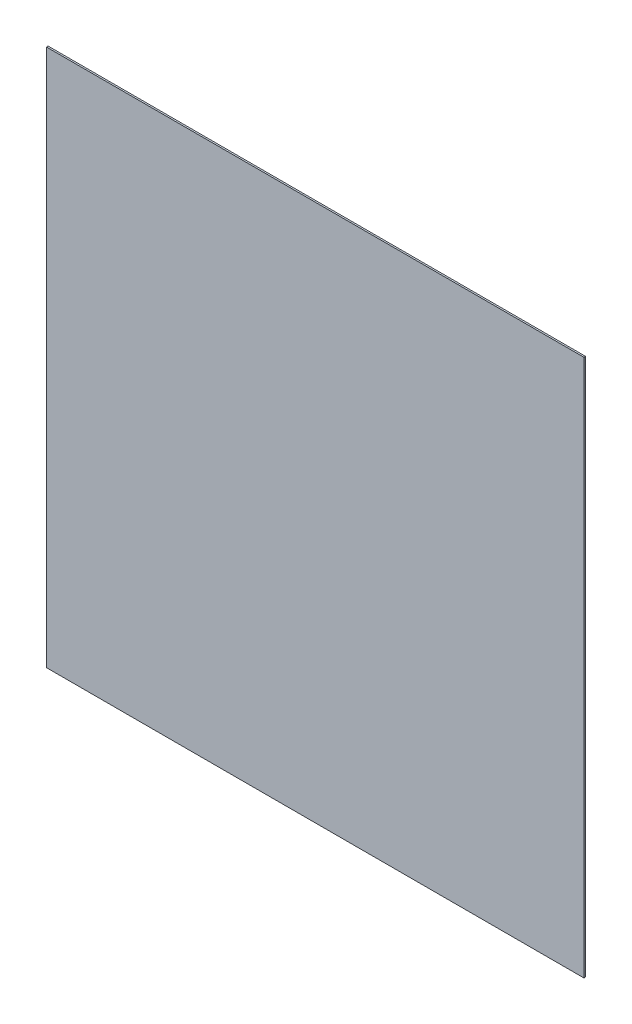
ISO-10303-21;
HEADER;
FILE_DESCRIPTION(('STEP AP214'),'2;1');
FILE_NAME('part.step','',(''),(''),'','','');
FILE_SCHEMA(('AUTOMOTIVE_DESIGN { 1 0 10303 214 1 1 1 1 }'));
ENDSEC;
DATA;
#1=APPLICATION_CONTEXT('core data for automotive mechanical design processes');
#2=APPLICATION_PROTOCOL_DEFINITION('international standard','automotive_design',2000,#1);
#3=PRODUCT_CONTEXT('',#1,'mechanical');
#4=PRODUCT('Part','Part','',(#3));
#5=PRODUCT_RELATED_PRODUCT_CATEGORY('part','',(#4));
#6=PRODUCT_DEFINITION_FORMATION('','',#4);
#7=PRODUCT_DEFINITION_CONTEXT('part definition',#1,'design');
#8=PRODUCT_DEFINITION('design','',#6,#7);
#9=PRODUCT_DEFINITION_SHAPE('','',#8);
#10=(LENGTH_UNIT() NAMED_UNIT(*) SI_UNIT(.MILLI.,.METRE.));
#11=(NAMED_UNIT(*) PLANE_ANGLE_UNIT() SI_UNIT($,.RADIAN.));
#12=(NAMED_UNIT(*) SI_UNIT($,.STERADIAN.) SOLID_ANGLE_UNIT());
#13=UNCERTAINTY_MEASURE_WITH_UNIT(LENGTH_MEASURE(1.E-05),#10,'distance_accuracy_value','');
#14=(GEOMETRIC_REPRESENTATION_CONTEXT(3) GLOBAL_UNCERTAINTY_ASSIGNED_CONTEXT((#13)) GLOBAL_UNIT_ASSIGNED_CONTEXT((#10,
#11,#12)) REPRESENTATION_CONTEXT('',''));
#15=CARTESIAN_POINT('',(0.,0.,0.));
#16=DIRECTION('',(0.,0.,1.));
#17=DIRECTION('',(1.,0.,0.));
#18=AXIS2_PLACEMENT_3D('',#15,#16,#17);
#19=CARTESIAN_POINT('',(62.7700680934936,44.9155550842403,13.74394));
#20=DIRECTION('',(0.,1.,0.));
#21=DIRECTION('',(0.,0.,-1.));
#22=AXIS2_PLACEMENT_3D('',#19,#20,#21);
#23=PLANE('',#22);
#24=DIRECTION('',(1.,0.,0.));
#25=VECTOR('',#24,1.);
#26=CARTESIAN_POINT('',(57.8170680934936,44.9155550842403,13.716));
#27=LINE('',#26,#25);
#28=CARTESIAN_POINT('',(53.6895680934936,44.9155550842403,13.716));
#29=VERTEX_POINT('',#28);
#30=CARTESIAN_POINT('',(61.9445680934936,44.9155550842403,13.716));
#31=VERTEX_POINT('',#30);
#32=EDGE_CURVE('E77',#29,#31,#27,.T.);
#33=ORIENTED_EDGE('',*,*,#32,.F.);
#34=DIRECTION('',(0.,0.,-1.));
#35=VECTOR('',#34,1.);
#36=CARTESIAN_POINT('',(53.6895680934936,44.9155550842403,13.7287));
#37=LINE('',#36,#35);
#38=CARTESIAN_POINT('',(53.6895680934936,44.9155550842403,13.7414));
#39=VERTEX_POINT('',#38);
#40=EDGE_CURVE('E69',#39,#29,#37,.T.);
#41=ORIENTED_EDGE('',*,*,#40,.F.);
#42=DIRECTION('',(-1.,0.,0.));
#43=VECTOR('',#42,1.);
#44=CARTESIAN_POINT('',(57.8170680934936,44.9155550842403,13.7414));
#45=LINE('',#44,#43);
#46=CARTESIAN_POINT('',(61.9445680934936,44.9155550842403,13.7414));
#47=VERTEX_POINT('',#46);
#48=EDGE_CURVE('E68',#47,#39,#45,.T.);
#49=ORIENTED_EDGE('',*,*,#48,.F.);
#50=DIRECTION('',(0.,0.,-1.));
#51=VECTOR('',#50,1.);
#52=CARTESIAN_POINT('',(61.9445680934936,44.9155550842403,13.7287));
#53=LINE('',#52,#51);
#54=EDGE_CURVE('E34',#47,#31,#53,.T.);
#55=ORIENTED_EDGE('',*,*,#54,.T.);
#56=EDGE_LOOP('',(#33,#41,#49,#55));
#57=FACE_BOUND('',#56,.T.);
#58=ADVANCED_FACE('F17',(#57),#23,.T.);
#59=CARTESIAN_POINT('',(62.7700680934936,36.6605550842403,13.71346));
#60=DIRECTION('',(0.,-1.,0.));
#61=DIRECTION('',(0.,0.,1.));
#62=AXIS2_PLACEMENT_3D('',#59,#60,#61);
#63=PLANE('',#62);
#64=DIRECTION('',(-1.,0.,0.));
#65=VECTOR('',#64,1.);
#66=CARTESIAN_POINT('',(57.8170680934936,36.6605550842403,13.716));
#67=LINE('',#66,#65);
#68=CARTESIAN_POINT('',(61.9445680934936,36.6605550842403,13.716));
#69=VERTEX_POINT('',#68);
#70=CARTESIAN_POINT('',(53.6895680934936,36.6605550842403,13.716));
#71=VERTEX_POINT('',#70);
#72=EDGE_CURVE('E85',#69,#71,#67,.T.);
#73=ORIENTED_EDGE('',*,*,#72,.F.);
#74=DIRECTION('',(0.,0.,1.));
#75=VECTOR('',#74,1.);
#76=CARTESIAN_POINT('',(61.9445680934936,36.6605550842403,13.7287));
#77=LINE('',#76,#75);
#78=CARTESIAN_POINT('',(61.9445680934936,36.6605550842403,13.7414));
#79=VERTEX_POINT('',#78);
#80=EDGE_CURVE('E74',#69,#79,#77,.T.);
#81=ORIENTED_EDGE('',*,*,#80,.T.);
#82=DIRECTION('',(1.,0.,0.));
#83=VECTOR('',#82,1.);
#84=CARTESIAN_POINT('',(57.8170680934936,36.6605550842403,13.7414));
#85=LINE('',#84,#83);
#86=CARTESIAN_POINT('',(53.6895680934936,36.6605550842403,13.7414));
#87=VERTEX_POINT('',#86);
#88=EDGE_CURVE('E72',#87,#79,#85,.T.);
#89=ORIENTED_EDGE('',*,*,#88,.F.);
#90=DIRECTION('',(0.,0.,1.));
#91=VECTOR('',#90,1.);
#92=CARTESIAN_POINT('',(53.6895680934936,36.6605550842403,13.7287));
#93=LINE('',#92,#91);
#94=EDGE_CURVE('E51',#71,#87,#93,.T.);
#95=ORIENTED_EDGE('',*,*,#94,.F.);
#96=EDGE_LOOP('',(#73,#81,#89,#95));
#97=FACE_BOUND('',#96,.T.);
#98=ADVANCED_FACE('F73',(#97),#63,.T.);
#99=CARTESIAN_POINT('',(53.6895680934936,45.7410550842403,13.74394));
#100=DIRECTION('',(-1.,0.,0.));
#101=DIRECTION('',(0.,0.,-1.));
#102=AXIS2_PLACEMENT_3D('',#99,#100,#101);
#103=PLANE('',#102);
#104=DIRECTION('',(0.,1.,0.));
#105=VECTOR('',#104,1.);
#106=CARTESIAN_POINT('',(53.6895680934936,40.7880550842403,13.716));
#107=LINE('',#106,#105);
#108=EDGE_CURVE('E66',#71,#29,#107,.T.);
#109=ORIENTED_EDGE('',*,*,#108,.F.);
#110=ORIENTED_EDGE('',*,*,#94,.T.);
#111=DIRECTION('',(0.,-1.,0.));
#112=VECTOR('',#111,1.);
#113=CARTESIAN_POINT('',(53.6895680934936,40.7880550842403,13.7414));
#114=LINE('',#113,#112);
#115=EDGE_CURVE('E63',#39,#87,#114,.T.);
#116=ORIENTED_EDGE('',*,*,#115,.F.);
#117=ORIENTED_EDGE('',*,*,#40,.T.);
#118=EDGE_LOOP('',(#109,#110,#116,#117));
#119=FACE_BOUND('',#118,.T.);
#120=ADVANCED_FACE('F60',(#119),#103,.T.);
#121=CARTESIAN_POINT('',(52.8640680934936,35.8350550842403,13.7414));
#122=DIRECTION('',(0.,0.,1.));
#123=DIRECTION('',(1.,0.,0.));
#124=AXIS2_PLACEMENT_3D('',#121,#122,#123);
#125=PLANE('',#124);
#126=ORIENTED_EDGE('',*,*,#115,.T.);
#127=ORIENTED_EDGE('',*,*,#88,.T.);
#128=DIRECTION('',(0.,-1.,0.));
#129=VECTOR('',#128,1.);
#130=CARTESIAN_POINT('',(61.9445680934936,40.7880550842403,13.7414));
#131=LINE('',#130,#129);
#132=EDGE_CURVE('E21',#47,#79,#131,.T.);
#133=ORIENTED_EDGE('',*,*,#132,.F.);
#134=ORIENTED_EDGE('',*,*,#48,.T.);
#135=EDGE_LOOP('',(#126,#127,#133,#134));
#136=FACE_BOUND('',#135,.T.);
#137=ADVANCED_FACE('F79',(#136),#125,.T.);
#138=CARTESIAN_POINT('',(52.8640680934936,45.7410550842403,13.716));
#139=DIRECTION('',(0.,0.,-1.));
#140=DIRECTION('',(1.,0.,0.));
#141=AXIS2_PLACEMENT_3D('',#138,#139,#140);
#142=PLANE('',#141);
#143=ORIENTED_EDGE('',*,*,#72,.T.);
#144=ORIENTED_EDGE('',*,*,#108,.T.);
#145=ORIENTED_EDGE('',*,*,#32,.T.);
#146=DIRECTION('',(0.,1.,0.));
#147=VECTOR('',#146,1.);
#148=CARTESIAN_POINT('',(61.9445680934936,40.7880550842403,13.716));
#149=LINE('',#148,#147);
#150=EDGE_CURVE('E11',#69,#31,#149,.T.);
#151=ORIENTED_EDGE('',*,*,#150,.F.);
#152=EDGE_LOOP('',(#143,#144,#145,#151));
#153=FACE_BOUND('',#152,.T.);
#154=ADVANCED_FACE('F89',(#153),#142,.T.);
#155=CARTESIAN_POINT('',(61.9445680934936,45.7410550842403,13.71346));
#156=DIRECTION('',(1.,0.,0.));
#157=DIRECTION('',(0.,0.,1.));
#158=AXIS2_PLACEMENT_3D('',#155,#156,#157);
#159=PLANE('',#158);
#160=ORIENTED_EDGE('',*,*,#150,.T.);
#161=ORIENTED_EDGE('',*,*,#54,.F.);
#162=ORIENTED_EDGE('',*,*,#132,.T.);
#163=ORIENTED_EDGE('',*,*,#80,.F.);
#164=EDGE_LOOP('',(#160,#161,#162,#163));
#165=FACE_BOUND('',#164,.T.);
#166=ADVANCED_FACE('F19',(#165),#159,.T.);
#167=CLOSED_SHELL('',(#58,#98,#120,#137,#154,#166));
#168=MANIFOLD_SOLID_BREP('B1',#167);
#169=ADVANCED_BREP_SHAPE_REPRESENTATION('',(#18,#168),#14);
#170=SHAPE_DEFINITION_REPRESENTATION(#9,#169);
ENDSEC;
END-ISO-10303-21;
